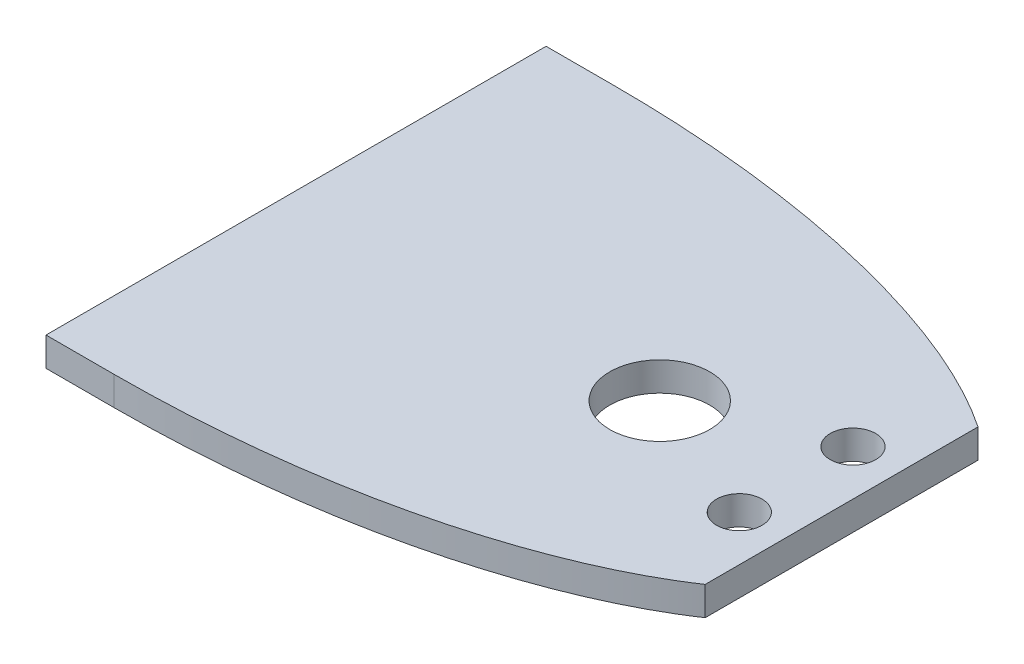
ISO-10303-21;
HEADER;
FILE_DESCRIPTION(('STEP AP214'),'2;1');
FILE_NAME('part.step','',(''),(''),'','','');
FILE_SCHEMA(('AUTOMOTIVE_DESIGN { 1 0 10303 214 1 1 1 1 }'));
ENDSEC;
DATA;
#1=APPLICATION_CONTEXT('core data for automotive mechanical design processes');
#2=APPLICATION_PROTOCOL_DEFINITION('international standard','automotive_design',2000,#1);
#3=PRODUCT_CONTEXT('',#1,'mechanical');
#4=PRODUCT('Part','Part','',(#3));
#5=PRODUCT_RELATED_PRODUCT_CATEGORY('part','',(#4));
#6=PRODUCT_DEFINITION_FORMATION('','',#4);
#7=PRODUCT_DEFINITION_CONTEXT('part definition',#1,'design');
#8=PRODUCT_DEFINITION('design','',#6,#7);
#9=PRODUCT_DEFINITION_SHAPE('','',#8);
#10=(LENGTH_UNIT() NAMED_UNIT(*) SI_UNIT(.MILLI.,.METRE.));
#11=(NAMED_UNIT(*) PLANE_ANGLE_UNIT() SI_UNIT($,.RADIAN.));
#12=(NAMED_UNIT(*) SI_UNIT($,.STERADIAN.) SOLID_ANGLE_UNIT());
#13=UNCERTAINTY_MEASURE_WITH_UNIT(LENGTH_MEASURE(1.E-05),#10,'distance_accuracy_value','');
#14=(GEOMETRIC_REPRESENTATION_CONTEXT(3) GLOBAL_UNCERTAINTY_ASSIGNED_CONTEXT((#13)) GLOBAL_UNIT_ASSIGNED_CONTEXT((#10,
#11,#12)) REPRESENTATION_CONTEXT('',''));
#15=CARTESIAN_POINT('',(0.,0.,0.));
#16=DIRECTION('',(0.,0.,1.));
#17=DIRECTION('',(1.,0.,0.));
#18=AXIS2_PLACEMENT_3D('',#15,#16,#17);
#19=CARTESIAN_POINT('',(0.,6.35,-54.9999999999999));
#20=DIRECTION('',(0.,1.,0.));
#21=DIRECTION('',(-1.,0.,0.));
#22=AXIS2_PLACEMENT_3D('',#19,#20,#21);
#23=ELLIPSE('',#22,125.277339390274,54.9999999999999);
#24=DIRECTION('',(0.,-1.,0.));
#25=VECTOR('',#24,1.);
#26=SURFACE_OF_LINEAR_EXTRUSION('',#23,#25);
#27=CARTESIAN_POINT('',(0.,0.,-54.9999999999999));
#28=DIRECTION('',(0.,1.,0.));
#29=DIRECTION('',(-1.,0.,0.));
#30=AXIS2_PLACEMENT_3D('',#27,#28,#29);
#31=ELLIPSE('',#30,125.277339390274,54.9999999999999);
#32=CARTESIAN_POINT('',(105.,0.,-85.0000000000002));
#33=VERTEX_POINT('',#32);
#34=CARTESIAN_POINT('',(-1.31221047798318E-12,0.,-110.));
#35=VERTEX_POINT('',#34);
#36=EDGE_CURVE('E140',#33,#35,#31,.T.);
#37=ORIENTED_EDGE('',*,*,#36,.T.);
#38=DIRECTION('',(0.,-1.,0.));
#39=VECTOR('',#38,1.);
#40=CARTESIAN_POINT('',(0.,6.35,-110.));
#41=LINE('',#40,#39);
#42=CARTESIAN_POINT('',(0.,6.35,-110.));
#43=VERTEX_POINT('',#42);
#44=EDGE_CURVE('E11',#43,#35,#41,.T.);
#45=ORIENTED_EDGE('',*,*,#44,.F.);
#46=CARTESIAN_POINT('',(105.,6.35,-85.0000000000002));
#47=VERTEX_POINT('',#46);
#48=EDGE_CURVE('E81',#47,#43,#23,.T.);
#49=ORIENTED_EDGE('',*,*,#48,.F.);
#50=DIRECTION('',(0.,-1.,0.));
#51=VECTOR('',#50,1.);
#52=CARTESIAN_POINT('',(105.,6.35,-85.0000000000002));
#53=LINE('',#52,#51);
#54=EDGE_CURVE('E193',#47,#33,#53,.T.);
#55=ORIENTED_EDGE('',*,*,#54,.T.);
#56=EDGE_LOOP('',(#37,#45,#49,#55));
#57=FACE_BOUND('',#56,.T.);
#58=ADVANCED_FACE('F39',(#57),#26,.F.);
#59=CARTESIAN_POINT('',(0.,6.35,-54.9999999999999));
#60=DIRECTION('',(0.,1.,0.));
#61=DIRECTION('',(-1.,0.,0.));
#62=AXIS2_PLACEMENT_3D('',#59,#60,#61);
#63=ELLIPSE('',#62,125.277339390274,55.0000000000002);
#64=DIRECTION('',(0.,-1.,0.));
#65=VECTOR('',#64,1.);
#66=SURFACE_OF_LINEAR_EXTRUSION('',#63,#65);
#67=CARTESIAN_POINT('',(0.,0.,-54.9999999999999));
#68=DIRECTION('',(0.,1.,0.));
#69=DIRECTION('',(-1.,0.,0.));
#70=AXIS2_PLACEMENT_3D('',#67,#68,#69);
#71=ELLIPSE('',#70,125.277339390274,55.0000000000002);
#72=CARTESIAN_POINT('',(0.,0.,0.));
#73=VERTEX_POINT('',#72);
#74=CARTESIAN_POINT('',(105.,0.,-24.9999999999999));
#75=VERTEX_POINT('',#74);
#76=EDGE_CURVE('E70',#73,#75,#71,.T.);
#77=ORIENTED_EDGE('',*,*,#76,.T.);
#78=DIRECTION('',(0.,-1.,0.));
#79=VECTOR('',#78,1.);
#80=CARTESIAN_POINT('',(105.,6.35,-24.9999999999999));
#81=LINE('',#80,#79);
#82=CARTESIAN_POINT('',(105.,6.35,-24.9999999999999));
#83=VERTEX_POINT('',#82);
#84=EDGE_CURVE('E197',#83,#75,#81,.T.);
#85=ORIENTED_EDGE('',*,*,#84,.F.);
#86=CARTESIAN_POINT('',(0.,6.35,0.));
#87=VERTEX_POINT('',#86);
#88=EDGE_CURVE('E150',#87,#83,#63,.T.);
#89=ORIENTED_EDGE('',*,*,#88,.F.);
#90=DIRECTION('',(0.,-1.,0.));
#91=VECTOR('',#90,1.);
#92=CARTESIAN_POINT('',(0.,6.35,0.));
#93=LINE('',#92,#91);
#94=EDGE_CURVE('E48',#87,#73,#93,.T.);
#95=ORIENTED_EDGE('',*,*,#94,.T.);
#96=EDGE_LOOP('',(#77,#85,#89,#95));
#97=FACE_BOUND('',#96,.T.);
#98=ADVANCED_FACE('F154',(#97),#66,.F.);
#99=CARTESIAN_POINT('',(105.,6.35,-85.0000000000002));
#100=DIRECTION('',(-1.,0.,0.));
#101=DIRECTION('',(0.,0.,1.));
#102=AXIS2_PLACEMENT_3D('',#99,#100,#101);
#103=PLANE('',#102);
#104=DIRECTION('',(0.,0.,-1.));
#105=VECTOR('',#104,1.);
#106=CARTESIAN_POINT('',(105.,0.,-85.0000000000002));
#107=LINE('',#106,#105);
#108=EDGE_CURVE('E76',#75,#33,#107,.T.);
#109=ORIENTED_EDGE('',*,*,#108,.T.);
#110=ORIENTED_EDGE('',*,*,#54,.F.);
#111=DIRECTION('',(0.,0.,-1.));
#112=VECTOR('',#111,1.);
#113=CARTESIAN_POINT('',(105.,6.35,-85.0000000000002));
#114=LINE('',#113,#112);
#115=EDGE_CURVE('E56',#83,#47,#114,.T.);
#116=ORIENTED_EDGE('',*,*,#115,.F.);
#117=ORIENTED_EDGE('',*,*,#84,.T.);
#118=EDGE_LOOP('',(#109,#110,#116,#117));
#119=FACE_BOUND('',#118,.T.);
#120=ADVANCED_FACE('F157',(#119),#103,.F.);
#121=CARTESIAN_POINT('',(0.,6.35,-54.9999999999999));
#122=DIRECTION('',(0.,1.,0.));
#123=DIRECTION('',(0.,0.,1.));
#124=AXIS2_PLACEMENT_3D('',#121,#122,#123);
#125=PLANE('',#124);
#126=CARTESIAN_POINT('',(65.,6.35,-55.0000000000002));
#127=DIRECTION('',(0.,1.,0.));
#128=DIRECTION('',(0.,0.,1.));
#129=AXIS2_PLACEMENT_3D('',#126,#127,#128);
#130=CIRCLE('',#129,11.);
#131=CARTESIAN_POINT('',(65.,6.35,-44.0000000000002));
#132=VERTEX_POINT('',#131);
#133=EDGE_CURVE('E131',#132,#132,#130,.T.);
#134=ORIENTED_EDGE('',*,*,#133,.F.);
#135=EDGE_LOOP('',(#134));
#136=FACE_BOUND('',#135,.T.);
#137=CARTESIAN_POINT('',(95.0000000000001,6.35,-67.4999999999999));
#138=DIRECTION('',(0.,1.,0.));
#139=DIRECTION('',(0.,0.,1.));
#140=AXIS2_PLACEMENT_3D('',#137,#138,#139);
#141=CIRCLE('',#140,5.00000000000001);
#142=CARTESIAN_POINT('',(95.0000000000001,6.35,-62.4999999999999));
#143=VERTEX_POINT('',#142);
#144=EDGE_CURVE('E137',#143,#143,#141,.T.);
#145=ORIENTED_EDGE('',*,*,#144,.F.);
#146=EDGE_LOOP('',(#145));
#147=FACE_BOUND('',#146,.T.);
#148=CARTESIAN_POINT('',(95.0000000000001,6.35,-42.4999999999999));
#149=DIRECTION('',(0.,1.,0.));
#150=DIRECTION('',(0.,0.,1.));
#151=AXIS2_PLACEMENT_3D('',#148,#149,#150);
#152=CIRCLE('',#151,5.00000000000001);
#153=CARTESIAN_POINT('',(95.0000000000001,6.35,-37.4999999999999));
#154=VERTEX_POINT('',#153);
#155=EDGE_CURVE('E144',#154,#154,#152,.T.);
#156=ORIENTED_EDGE('',*,*,#155,.F.);
#157=EDGE_LOOP('',(#156));
#158=FACE_BOUND('',#157,.T.);
#159=ORIENTED_EDGE('',*,*,#48,.T.);
#160=DIRECTION('',(-1.,0.,0.));
#161=VECTOR('',#160,1.);
#162=CARTESIAN_POINT('',(-1.31221047798318E-12,6.35,-110.));
#163=LINE('',#162,#161);
#164=CARTESIAN_POINT('',(-15.0000000000013,6.35,-110.));
#165=VERTEX_POINT('',#164);
#166=EDGE_CURVE('E98',#43,#165,#163,.T.);
#167=ORIENTED_EDGE('',*,*,#166,.T.);
#168=DIRECTION('',(0.,0.,1.));
#169=VECTOR('',#168,1.);
#170=CARTESIAN_POINT('',(-15.0000000000013,6.35,-110.));
#171=LINE('',#170,#169);
#172=CARTESIAN_POINT('',(-15.0000000000013,6.35,0.));
#173=VERTEX_POINT('',#172);
#174=EDGE_CURVE('E103',#165,#173,#171,.T.);
#175=ORIENTED_EDGE('',*,*,#174,.T.);
#176=DIRECTION('',(1.,0.,0.));
#177=VECTOR('',#176,1.);
#178=CARTESIAN_POINT('',(-15.0000000000013,6.35,0.));
#179=LINE('',#178,#177);
#180=EDGE_CURVE('E121',#173,#87,#179,.T.);
#181=ORIENTED_EDGE('',*,*,#180,.T.);
#182=ORIENTED_EDGE('',*,*,#88,.T.);
#183=ORIENTED_EDGE('',*,*,#115,.T.);
#184=EDGE_LOOP('',(#159,#167,#175,#181,#182,#183));
#185=FACE_BOUND('',#184,.T.);
#186=ADVANCED_FACE('F100',(#136,#147,#158,#185),#125,.T.);
#187=CARTESIAN_POINT('',(0.,0.,-54.9999999999999));
#188=DIRECTION('',(0.,1.,0.));
#189=DIRECTION('',(0.,0.,1.));
#190=AXIS2_PLACEMENT_3D('',#187,#188,#189);
#191=PLANE('',#190);
#192=CARTESIAN_POINT('',(65.,0.,-55.0000000000002));
#193=DIRECTION('',(0.,1.,0.));
#194=DIRECTION('',(0.,0.,1.));
#195=AXIS2_PLACEMENT_3D('',#192,#193,#194);
#196=CIRCLE('',#195,11.);
#197=CARTESIAN_POINT('',(65.,0.,-44.0000000000002));
#198=VERTEX_POINT('',#197);
#199=EDGE_CURVE('E115',#198,#198,#196,.T.);
#200=ORIENTED_EDGE('',*,*,#199,.T.);
#201=EDGE_LOOP('',(#200));
#202=FACE_BOUND('',#201,.T.);
#203=CARTESIAN_POINT('',(95.0000000000001,0.,-67.4999999999999));
#204=DIRECTION('',(0.,1.,0.));
#205=DIRECTION('',(0.,0.,1.));
#206=AXIS2_PLACEMENT_3D('',#203,#204,#205);
#207=CIRCLE('',#206,5.00000000000001);
#208=CARTESIAN_POINT('',(95.0000000000001,0.,-62.4999999999999));
#209=VERTEX_POINT('',#208);
#210=EDGE_CURVE('E141',#209,#209,#207,.T.);
#211=ORIENTED_EDGE('',*,*,#210,.T.);
#212=EDGE_LOOP('',(#211));
#213=FACE_BOUND('',#212,.T.);
#214=CARTESIAN_POINT('',(95.0000000000001,0.,-42.4999999999999));
#215=DIRECTION('',(0.,1.,0.));
#216=DIRECTION('',(0.,0.,1.));
#217=AXIS2_PLACEMENT_3D('',#214,#215,#216);
#218=CIRCLE('',#217,5.00000000000001);
#219=CARTESIAN_POINT('',(95.0000000000001,0.,-37.4999999999999));
#220=VERTEX_POINT('',#219);
#221=EDGE_CURVE('E134',#220,#220,#218,.T.);
#222=ORIENTED_EDGE('',*,*,#221,.T.);
#223=EDGE_LOOP('',(#222));
#224=FACE_BOUND('',#223,.T.);
#225=ORIENTED_EDGE('',*,*,#36,.F.);
#226=ORIENTED_EDGE('',*,*,#108,.F.);
#227=ORIENTED_EDGE('',*,*,#76,.F.);
#228=DIRECTION('',(1.,0.,0.));
#229=VECTOR('',#228,1.);
#230=CARTESIAN_POINT('',(-15.0000000000013,0.,0.));
#231=LINE('',#230,#229);
#232=CARTESIAN_POINT('',(-15.0000000000013,0.,0.));
#233=VERTEX_POINT('',#232);
#234=EDGE_CURVE('E106',#233,#73,#231,.T.);
#235=ORIENTED_EDGE('',*,*,#234,.F.);
#236=DIRECTION('',(0.,0.,1.));
#237=VECTOR('',#236,1.);
#238=CARTESIAN_POINT('',(-15.0000000000013,0.,-110.));
#239=LINE('',#238,#237);
#240=CARTESIAN_POINT('',(-15.0000000000013,0.,-110.));
#241=VERTEX_POINT('',#240);
#242=EDGE_CURVE('E126',#241,#233,#239,.T.);
#243=ORIENTED_EDGE('',*,*,#242,.F.);
#244=DIRECTION('',(-1.,0.,0.));
#245=VECTOR('',#244,1.);
#246=CARTESIAN_POINT('',(-1.31221047798318E-12,0.,-110.));
#247=LINE('',#246,#245);
#248=EDGE_CURVE('E112',#35,#241,#247,.T.);
#249=ORIENTED_EDGE('',*,*,#248,.F.);
#250=EDGE_LOOP('',(#225,#226,#227,#235,#243,#249));
#251=FACE_BOUND('',#250,.T.);
#252=ADVANCED_FACE('F160',(#202,#213,#224,#251),#191,.F.);
#253=CARTESIAN_POINT('',(95.0000000000001,6.35,-42.4999999999999));
#254=DIRECTION('',(0.,-1.,0.));
#255=DIRECTION('',(0.,0.,-1.));
#256=AXIS2_PLACEMENT_3D('',#253,#254,#255);
#257=CYLINDRICAL_SURFACE('',#256,5.00000000000001);
#258=ORIENTED_EDGE('',*,*,#155,.T.);
#259=EDGE_LOOP('',(#258));
#260=FACE_BOUND('',#259,.T.);
#261=ORIENTED_EDGE('',*,*,#221,.F.);
#262=EDGE_LOOP('',(#261));
#263=FACE_BOUND('',#262,.T.);
#264=ADVANCED_FACE('F163',(#260,#263),#257,.F.);
#265=CARTESIAN_POINT('',(95.0000000000001,6.35,-67.4999999999999));
#266=DIRECTION('',(0.,-1.,0.));
#267=DIRECTION('',(0.,0.,-1.));
#268=AXIS2_PLACEMENT_3D('',#265,#266,#267);
#269=CYLINDRICAL_SURFACE('',#268,5.00000000000001);
#270=ORIENTED_EDGE('',*,*,#144,.T.);
#271=EDGE_LOOP('',(#270));
#272=FACE_BOUND('',#271,.T.);
#273=ORIENTED_EDGE('',*,*,#210,.F.);
#274=EDGE_LOOP('',(#273));
#275=FACE_BOUND('',#274,.T.);
#276=ADVANCED_FACE('F170',(#272,#275),#269,.F.);
#277=CARTESIAN_POINT('',(65.,6.35,-55.0000000000002));
#278=DIRECTION('',(0.,-1.,0.));
#279=DIRECTION('',(0.,0.,-1.));
#280=AXIS2_PLACEMENT_3D('',#277,#278,#279);
#281=CYLINDRICAL_SURFACE('',#280,11.);
#282=ORIENTED_EDGE('',*,*,#133,.T.);
#283=EDGE_LOOP('',(#282));
#284=FACE_BOUND('',#283,.T.);
#285=ORIENTED_EDGE('',*,*,#199,.F.);
#286=EDGE_LOOP('',(#285));
#287=FACE_BOUND('',#286,.T.);
#288=ADVANCED_FACE('F174',(#284,#287),#281,.F.);
#289=CARTESIAN_POINT('',(-1.31221047798318E-12,6.35,-110.));
#290=DIRECTION('',(0.,0.,1.));
#291=DIRECTION('',(1.,0.,0.));
#292=AXIS2_PLACEMENT_3D('',#289,#290,#291);
#293=PLANE('',#292);
#294=ORIENTED_EDGE('',*,*,#248,.T.);
#295=DIRECTION('',(0.,-1.,0.));
#296=VECTOR('',#295,1.);
#297=CARTESIAN_POINT('',(-15.0000000000013,6.35,-110.));
#298=LINE('',#297,#296);
#299=EDGE_CURVE('E109',#165,#241,#298,.T.);
#300=ORIENTED_EDGE('',*,*,#299,.F.);
#301=ORIENTED_EDGE('',*,*,#166,.F.);
#302=ORIENTED_EDGE('',*,*,#44,.T.);
#303=EDGE_LOOP('',(#294,#300,#301,#302));
#304=FACE_BOUND('',#303,.T.);
#305=ADVANCED_FACE('F110',(#304),#293,.F.);
#306=CARTESIAN_POINT('',(-15.0000000000013,6.35,-110.));
#307=DIRECTION('',(1.,0.,0.));
#308=DIRECTION('',(0.,0.,-1.));
#309=AXIS2_PLACEMENT_3D('',#306,#307,#308);
#310=PLANE('',#309);
#311=ORIENTED_EDGE('',*,*,#242,.T.);
#312=DIRECTION('',(0.,-1.,0.));
#313=VECTOR('',#312,1.);
#314=CARTESIAN_POINT('',(-15.0000000000013,6.35,0.));
#315=LINE('',#314,#313);
#316=EDGE_CURVE('E116',#173,#233,#315,.T.);
#317=ORIENTED_EDGE('',*,*,#316,.F.);
#318=ORIENTED_EDGE('',*,*,#174,.F.);
#319=ORIENTED_EDGE('',*,*,#299,.T.);
#320=EDGE_LOOP('',(#311,#317,#318,#319));
#321=FACE_BOUND('',#320,.T.);
#322=ADVANCED_FACE('F118',(#321),#310,.F.);
#323=CARTESIAN_POINT('',(-15.0000000000013,6.35,0.));
#324=DIRECTION('',(0.,0.,-1.));
#325=DIRECTION('',(-1.,0.,0.));
#326=AXIS2_PLACEMENT_3D('',#323,#324,#325);
#327=PLANE('',#326);
#328=ORIENTED_EDGE('',*,*,#234,.T.);
#329=ORIENTED_EDGE('',*,*,#94,.F.);
#330=ORIENTED_EDGE('',*,*,#180,.F.);
#331=ORIENTED_EDGE('',*,*,#316,.T.);
#332=EDGE_LOOP('',(#328,#329,#330,#331));
#333=FACE_BOUND('',#332,.T.);
#334=ADVANCED_FACE('F183',(#333),#327,.F.);
#335=CLOSED_SHELL('',(#58,#98,#120,#186,#252,#264,#276,#288,#305,#322,#334));
#336=MANIFOLD_SOLID_BREP('B2',#335);
#337=ADVANCED_BREP_SHAPE_REPRESENTATION('',(#18,#336),#14);
#338=SHAPE_DEFINITION_REPRESENTATION(#9,#337);
ENDSEC;
END-ISO-10303-21;
